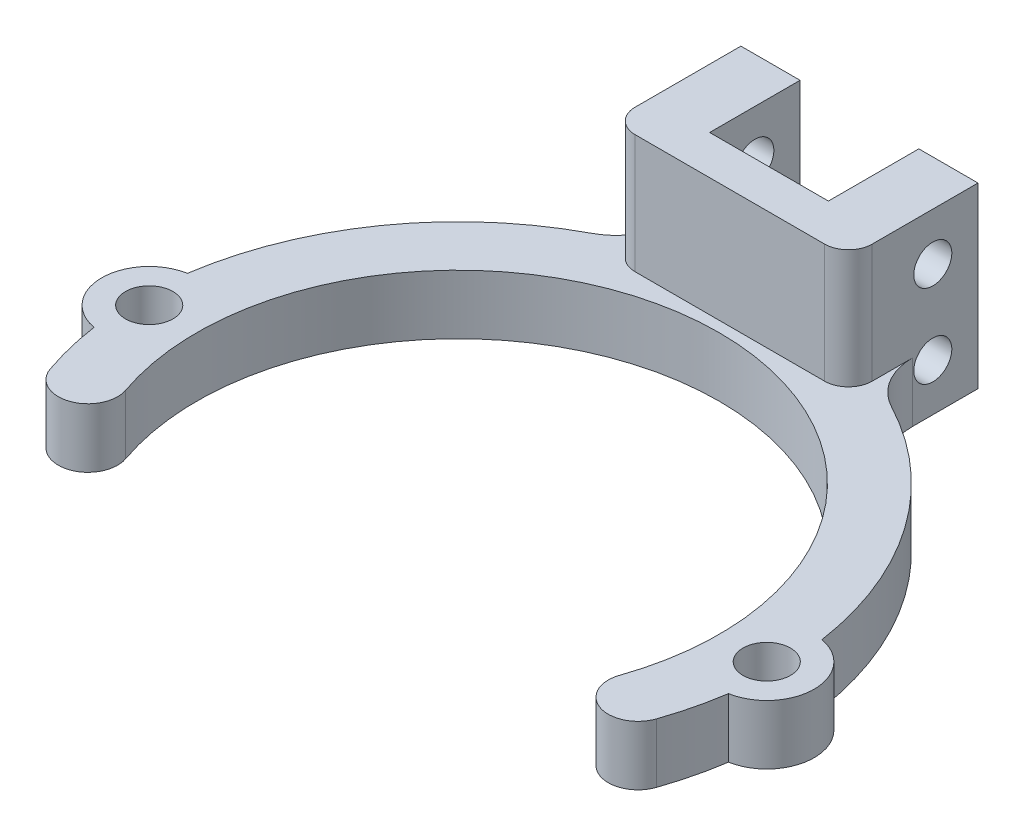
ISO-10303-21;
HEADER;
FILE_DESCRIPTION(('STEP AP214'),'2;1');
FILE_NAME('part.step','',(''),(''),'','','');
FILE_SCHEMA(('AUTOMOTIVE_DESIGN { 1 0 10303 214 1 1 1 1 }'));
ENDSEC;
DATA;
#1=APPLICATION_CONTEXT('core data for automotive mechanical design processes');
#2=APPLICATION_PROTOCOL_DEFINITION('international standard','automotive_design',2000,#1);
#3=PRODUCT_CONTEXT('',#1,'mechanical');
#4=PRODUCT('Part','Part','',(#3));
#5=PRODUCT_RELATED_PRODUCT_CATEGORY('part','',(#4));
#6=PRODUCT_DEFINITION_FORMATION('','',#4);
#7=PRODUCT_DEFINITION_CONTEXT('part definition',#1,'design');
#8=PRODUCT_DEFINITION('design','',#6,#7);
#9=PRODUCT_DEFINITION_SHAPE('','',#8);
#10=(LENGTH_UNIT() NAMED_UNIT(*) SI_UNIT(.MILLI.,.METRE.));
#11=(NAMED_UNIT(*) PLANE_ANGLE_UNIT() SI_UNIT($,.RADIAN.));
#12=(NAMED_UNIT(*) SI_UNIT($,.STERADIAN.) SOLID_ANGLE_UNIT());
#13=UNCERTAINTY_MEASURE_WITH_UNIT(LENGTH_MEASURE(1.E-05),#10,'distance_accuracy_value','');
#14=(GEOMETRIC_REPRESENTATION_CONTEXT(3) GLOBAL_UNCERTAINTY_ASSIGNED_CONTEXT((#13)) GLOBAL_UNIT_ASSIGNED_CONTEXT((#10,
#11,#12)) REPRESENTATION_CONTEXT('',''));
#15=CARTESIAN_POINT('',(0.,0.,0.));
#16=DIRECTION('',(0.,0.,1.));
#17=DIRECTION('',(1.,0.,0.));
#18=AXIS2_PLACEMENT_3D('',#15,#16,#17);
#19=CARTESIAN_POINT('',(-11.5785361769095,5.,3.99999999999988));
#20=DIRECTION('',(0.,1.,0.));
#21=DIRECTION('',(0.,0.,1.));
#22=AXIS2_PLACEMENT_3D('',#19,#20,#21);
#23=PLANE('',#22);
#24=CARTESIAN_POINT('',(-26.,5.,0.));
#25=DIRECTION('',(0.,1.,0.));
#26=DIRECTION('',(0.,0.,1.));
#27=AXIS2_PLACEMENT_3D('',#24,#25,#26);
#28=CIRCLE('',#27,2.);
#29=CARTESIAN_POINT('',(-26.,5.,2.));
#30=VERTEX_POINT('',#29);
#31=EDGE_CURVE('E266',#30,#30,#28,.T.);
#32=ORIENTED_EDGE('',*,*,#31,.F.);
#33=EDGE_LOOP('',(#32));
#34=FACE_BOUND('',#33,.T.);
#35=CARTESIAN_POINT('',(26.,5.,-1.80411241501588E-13));
#36=DIRECTION('',(0.,1.,0.));
#37=DIRECTION('',(0.,0.,-1.));
#38=AXIS2_PLACEMENT_3D('',#35,#36,#37);
#39=CIRCLE('',#38,2.);
#40=CARTESIAN_POINT('',(26.,5.,-2.00000000000018));
#41=VERTEX_POINT('',#40);
#42=EDGE_CURVE('E260',#41,#41,#39,.T.);
#43=ORIENTED_EDGE('',*,*,#42,.F.);
#44=EDGE_LOOP('',(#43));
#45=FACE_BOUND('',#44,.T.);
#46=DIRECTION('',(0.,0.,1.));
#47=VECTOR('',#46,1.);
#48=CARTESIAN_POINT('',(9.98294678168634,5.,3.99999999999988));
#49=LINE('',#48,#47);
#50=CARTESIAN_POINT('',(9.98294678168634,5.,-28.2756309520611));
#51=VERTEX_POINT('',#50);
#52=CARTESIAN_POINT('',(9.98294678168634,5.,-24.8963876711339));
#53=VERTEX_POINT('',#52);
#54=EDGE_CURVE('E252',#51,#53,#49,.T.);
#55=ORIENTED_EDGE('',*,*,#54,.T.);
#56=CARTESIAN_POINT('',(7.98294678168634,5.,-24.8963876711339));
#57=DIRECTION('',(0.,1.,0.));
#58=DIRECTION('',(0.,0.,1.));
#59=AXIS2_PLACEMENT_3D('',#56,#57,#58);
#60=CIRCLE('',#59,2.);
#61=CARTESIAN_POINT('',(7.98294678168634,5.,-22.8963876711339));
#62=VERTEX_POINT('',#61);
#63=EDGE_CURVE('E42',#53,#62,#60,.F.);
#64=ORIENTED_EDGE('',*,*,#63,.T.);
#65=DIRECTION('',(-1.,0.,0.));
#66=VECTOR('',#65,1.);
#67=CARTESIAN_POINT('',(-11.5785361769095,5.,-22.8963876711339));
#68=LINE('',#67,#66);
#69=CARTESIAN_POINT('',(-7.98294678168635,5.,-22.8963876711339));
#70=VERTEX_POINT('',#69);
#71=EDGE_CURVE('E257',#62,#70,#68,.T.);
#72=ORIENTED_EDGE('',*,*,#71,.T.);
#73=CARTESIAN_POINT('',(-7.98294678168635,5.,-24.8963876711339));
#74=DIRECTION('',(0.,1.,0.));
#75=DIRECTION('',(0.,0.,1.));
#76=AXIS2_PLACEMENT_3D('',#73,#74,#75);
#77=CIRCLE('',#76,2.);
#78=CARTESIAN_POINT('',(-9.98294678168635,5.,-24.8963876711339));
#79=VERTEX_POINT('',#78);
#80=EDGE_CURVE('E11',#70,#79,#77,.F.);
#81=ORIENTED_EDGE('',*,*,#80,.T.);
#82=DIRECTION('',(0.,0.,-1.));
#83=VECTOR('',#82,1.);
#84=CARTESIAN_POINT('',(-9.98294678168635,5.,3.99999999999988));
#85=LINE('',#84,#83);
#86=CARTESIAN_POINT('',(-9.98294678168635,5.,-28.2756309520611));
#87=VERTEX_POINT('',#86);
#88=EDGE_CURVE('E255',#79,#87,#85,.T.);
#89=ORIENTED_EDGE('',*,*,#88,.T.);
#90=CARTESIAN_POINT('',(-14.9829467816863,5.,-28.2756309520611));
#91=DIRECTION('',(0.,1.,0.));
#92=DIRECTION('',(0.,0.,1.));
#93=AXIS2_PLACEMENT_3D('',#90,#91,#92);
#94=CIRCLE('',#93,5.);
#95=CARTESIAN_POINT('',(-12.6418613470479,5.,-23.8575636158015));
#96=VERTEX_POINT('',#95);
#97=EDGE_CURVE('E357',#87,#96,#94,.F.);
#98=ORIENTED_EDGE('',*,*,#97,.T.);
#99=CARTESIAN_POINT('',(0.,5.,0.));
#100=DIRECTION('',(0.,1.,0.));
#101=DIRECTION('',(0.,0.,1.));
#102=AXIS2_PLACEMENT_3D('',#99,#100,#101);
#103=CIRCLE('',#102,27.);
#104=CARTESIAN_POINT('',(-26.7115384615385,5.,-3.93620540848054));
#105=VERTEX_POINT('',#104);
#106=EDGE_CURVE('E284',#96,#105,#103,.T.);
#107=ORIENTED_EDGE('',*,*,#106,.T.);
#108=CARTESIAN_POINT('',(-26.,5.,0.));
#109=DIRECTION('',(0.,1.,0.));
#110=DIRECTION('',(0.,0.,1.));
#111=AXIS2_PLACEMENT_3D('',#108,#109,#110);
#112=CIRCLE('',#111,4.);
#113=CARTESIAN_POINT('',(-26.7115384615385,5.,3.93620540848054));
#114=VERTEX_POINT('',#113);
#115=EDGE_CURVE('E288',#105,#114,#112,.T.);
#116=ORIENTED_EDGE('',*,*,#115,.T.);
#117=CARTESIAN_POINT('',(0.,5.,0.));
#118=DIRECTION('',(0.,1.,0.));
#119=DIRECTION('',(0.,0.,1.));
#120=AXIS2_PLACEMENT_3D('',#117,#118,#119);
#121=CIRCLE('',#120,27.);
#122=CARTESIAN_POINT('',(-25.5200389205351,5.,8.81632653061199));
#123=VERTEX_POINT('',#122);
#124=EDGE_CURVE('E290',#114,#123,#121,.T.);
#125=ORIENTED_EDGE('',*,*,#124,.T.);
#126=CARTESIAN_POINT('',(-23.1570723538189,5.,7.99999999999977));
#127=DIRECTION('',(0.,1.,0.));
#128=DIRECTION('',(0.,0.,1.));
#129=AXIS2_PLACEMENT_3D('',#126,#127,#128);
#130=CIRCLE('',#129,2.5);
#131=CARTESIAN_POINT('',(-20.7941057871027,5.,7.18367346938754));
#132=VERTEX_POINT('',#131);
#133=EDGE_CURVE('E272',#123,#132,#130,.T.);
#134=ORIENTED_EDGE('',*,*,#133,.T.);
#135=CARTESIAN_POINT('',(0.,5.,0.));
#136=DIRECTION('',(0.,-1.,0.));
#137=DIRECTION('',(0.,0.,1.));
#138=AXIS2_PLACEMENT_3D('',#135,#136,#137);
#139=CIRCLE('',#138,22.);
#140=CARTESIAN_POINT('',(20.7941057871026,5.,7.18367346938775));
#141=VERTEX_POINT('',#140);
#142=EDGE_CURVE('E275',#132,#141,#139,.T.);
#143=ORIENTED_EDGE('',*,*,#142,.T.);
#144=CARTESIAN_POINT('',(23.1570723538188,5.,8.));
#145=DIRECTION('',(0.,1.,0.));
#146=DIRECTION('',(0.,0.,1.));
#147=AXIS2_PLACEMENT_3D('',#144,#145,#146);
#148=CIRCLE('',#147,2.5);
#149=CARTESIAN_POINT('',(25.520038920535,5.,8.81632653061224));
#150=VERTEX_POINT('',#149);
#151=EDGE_CURVE('E278',#141,#150,#148,.T.);
#152=ORIENTED_EDGE('',*,*,#151,.T.);
#153=CARTESIAN_POINT('',(0.,5.,0.));
#154=DIRECTION('',(0.,1.,0.));
#155=DIRECTION('',(0.,0.,1.));
#156=AXIS2_PLACEMENT_3D('',#153,#154,#155);
#157=CIRCLE('',#156,27.);
#158=CARTESIAN_POINT('',(26.7115384615385,5.,3.93620540848036));
#159=VERTEX_POINT('',#158);
#160=EDGE_CURVE('E280',#150,#159,#157,.T.);
#161=ORIENTED_EDGE('',*,*,#160,.T.);
#162=CARTESIAN_POINT('',(26.,5.,-1.80411241501588E-13));
#163=DIRECTION('',(0.,1.,0.));
#164=DIRECTION('',(0.,0.,-1.));
#165=AXIS2_PLACEMENT_3D('',#162,#163,#164);
#166=CIRCLE('',#165,4.);
#167=CARTESIAN_POINT('',(26.7115384615384,5.,-3.93620540848073));
#168=VERTEX_POINT('',#167);
#169=EDGE_CURVE('E282',#159,#168,#166,.T.);
#170=ORIENTED_EDGE('',*,*,#169,.T.);
#171=CARTESIAN_POINT('',(12.6418613470478,5.,-23.8575636158015));
#172=VERTEX_POINT('',#171);
#173=EDGE_CURVE('E285',#168,#172,#103,.T.);
#174=ORIENTED_EDGE('',*,*,#173,.T.);
#175=CARTESIAN_POINT('',(14.9829467816863,5.,-28.2756309520611));
#176=DIRECTION('',(0.,1.,0.));
#177=DIRECTION('',(0.,0.,1.));
#178=AXIS2_PLACEMENT_3D('',#175,#176,#177);
#179=CIRCLE('',#178,5.);
#180=EDGE_CURVE('E354',#172,#51,#179,.F.);
#181=ORIENTED_EDGE('',*,*,#180,.T.);
#182=EDGE_LOOP('',(#55,#64,#72,#81,#89,#98,#107,#116,#125,#134,#143,#152,#161,#170,#174,#181));
#183=FACE_BOUND('',#182,.T.);
#184=ADVANCED_FACE('F34',(#34,#45,#183),#23,.T.);
#185=CARTESIAN_POINT('',(0.,5.,0.));
#186=DIRECTION('',(0.,-1.,0.));
#187=DIRECTION('',(0.,0.,-1.));
#188=AXIS2_PLACEMENT_3D('',#185,#186,#187);
#189=CYLINDRICAL_SURFACE('',#188,27.);
#190=ORIENTED_EDGE('',*,*,#106,.F.);
#191=DIRECTION('',(0.,-1.,0.));
#192=VECTOR('',#191,1.);
#193=CARTESIAN_POINT('',(-12.6418613470479,5.,-23.8575636158015));
#194=LINE('',#193,#192);
#195=CARTESIAN_POINT('',(-12.6418613470479,0.,-23.8575636158015));
#196=VERTEX_POINT('',#195);
#197=EDGE_CURVE('E350',#96,#196,#194,.T.);
#198=ORIENTED_EDGE('',*,*,#197,.T.);
#199=CARTESIAN_POINT('',(0.,0.,0.));
#200=DIRECTION('',(0.,1.,0.));
#201=DIRECTION('',(0.,0.,1.));
#202=AXIS2_PLACEMENT_3D('',#199,#200,#201);
#203=CIRCLE('',#202,27.);
#204=CARTESIAN_POINT('',(-26.7115384615385,0.,-3.93620540848054));
#205=VERTEX_POINT('',#204);
#206=EDGE_CURVE('E303',#196,#205,#203,.T.);
#207=ORIENTED_EDGE('',*,*,#206,.T.);
#208=DIRECTION('',(0.,-1.,0.));
#209=VECTOR('',#208,1.);
#210=CARTESIAN_POINT('',(-26.7115384615385,5.,-3.93620540848054));
#211=LINE('',#210,#209);
#212=EDGE_CURVE('E315',#105,#205,#211,.T.);
#213=ORIENTED_EDGE('',*,*,#212,.F.);
#214=EDGE_LOOP('',(#190,#198,#207,#213));
#215=FACE_BOUND('',#214,.T.);
#216=ADVANCED_FACE('F461',(#215),#189,.T.);
#217=CARTESIAN_POINT('',(26.7115384615384,0.,-3.93620540848073));
#218=VERTEX_POINT('',#217);
#219=CARTESIAN_POINT('',(12.6418613470478,0.,-23.8575636158015));
#220=VERTEX_POINT('',#219);
#221=EDGE_CURVE('E304',#218,#220,#203,.T.);
#222=ORIENTED_EDGE('',*,*,#221,.T.);
#223=DIRECTION('',(0.,-1.,0.));
#224=VECTOR('',#223,1.);
#225=CARTESIAN_POINT('',(12.6418613470479,5.,-23.8575636158015));
#226=LINE('',#225,#224);
#227=EDGE_CURVE('E345',#220,#172,#226,.F.);
#228=ORIENTED_EDGE('',*,*,#227,.T.);
#229=ORIENTED_EDGE('',*,*,#173,.F.);
#230=DIRECTION('',(0.,-1.,0.));
#231=VECTOR('',#230,1.);
#232=CARTESIAN_POINT('',(26.7115384615384,5.,-3.93620540848073));
#233=LINE('',#232,#231);
#234=EDGE_CURVE('E318',#168,#218,#233,.T.);
#235=ORIENTED_EDGE('',*,*,#234,.T.);
#236=EDGE_LOOP('',(#222,#228,#229,#235));
#237=FACE_BOUND('',#236,.T.);
#238=ADVANCED_FACE('F404',(#237),#189,.T.);
#239=CARTESIAN_POINT('',(-11.5785361769095,0.,3.99999999999988));
#240=DIRECTION('',(0.,1.,0.));
#241=DIRECTION('',(0.,0.,1.));
#242=AXIS2_PLACEMENT_3D('',#239,#240,#241);
#243=PLANE('',#242);
#244=DIRECTION('',(0.,0.,-1.));
#245=VECTOR('',#244,1.);
#246=CARTESIAN_POINT('',(-5.,0.,-26.1929992232642));
#247=LINE('',#246,#245);
#248=CARTESIAN_POINT('',(-5.,0.,-26.1929992232642));
#249=VERTEX_POINT('',#248);
#250=CARTESIAN_POINT('',(-5.,0.,-33.8070007767358));
#251=VERTEX_POINT('',#250);
#252=EDGE_CURVE('E183',#249,#251,#247,.T.);
#253=ORIENTED_EDGE('',*,*,#252,.F.);
#254=DIRECTION('',(1.,0.,0.));
#255=VECTOR('',#254,1.);
#256=CARTESIAN_POINT('',(-5.,0.,-26.1929992232642));
#257=LINE('',#256,#255);
#258=CARTESIAN_POINT('',(4.99999999999999,0.,-26.1929992232642));
#259=VERTEX_POINT('',#258);
#260=EDGE_CURVE('E189',#249,#259,#257,.T.);
#261=ORIENTED_EDGE('',*,*,#260,.T.);
#262=DIRECTION('',(0.,0.,1.));
#263=VECTOR('',#262,1.);
#264=CARTESIAN_POINT('',(4.99999999999999,0.,-26.1929992232642));
#265=LINE('',#264,#263);
#266=CARTESIAN_POINT('',(4.99999999999999,0.,-33.8070007767358));
#267=VERTEX_POINT('',#266);
#268=EDGE_CURVE('E194',#267,#259,#265,.T.);
#269=ORIENTED_EDGE('',*,*,#268,.F.);
#270=DIRECTION('',(-1.,0.,0.));
#271=VECTOR('',#270,1.);
#272=CARTESIAN_POINT('',(9.98294678168634,0.,-33.8070007767358));
#273=LINE('',#272,#271);
#274=CARTESIAN_POINT('',(9.98294678168634,0.,-33.8070007767358));
#275=VERTEX_POINT('',#274);
#276=EDGE_CURVE('E238',#275,#267,#273,.T.);
#277=ORIENTED_EDGE('',*,*,#276,.F.);
#278=DIRECTION('',(0.,0.,-1.));
#279=VECTOR('',#278,1.);
#280=CARTESIAN_POINT('',(9.98294678168634,0.,-22.8963876711339));
#281=LINE('',#280,#279);
#282=CARTESIAN_POINT('',(9.98294678168634,0.,-28.2756309520611));
#283=VERTEX_POINT('',#282);
#284=EDGE_CURVE('E213',#283,#275,#281,.T.);
#285=ORIENTED_EDGE('',*,*,#284,.F.);
#286=CARTESIAN_POINT('',(14.9829467816863,0.,-28.2756309520611));
#287=DIRECTION('',(0.,1.,0.));
#288=DIRECTION('',(0.,0.,1.));
#289=AXIS2_PLACEMENT_3D('',#286,#287,#288);
#290=CIRCLE('',#289,5.);
#291=EDGE_CURVE('E352',#283,#220,#290,.T.);
#292=ORIENTED_EDGE('',*,*,#291,.T.);
#293=ORIENTED_EDGE('',*,*,#221,.F.);
#294=CARTESIAN_POINT('',(26.,0.,-1.80411241501588E-13));
#295=DIRECTION('',(0.,1.,0.));
#296=DIRECTION('',(0.,0.,-1.));
#297=AXIS2_PLACEMENT_3D('',#294,#295,#296);
#298=CIRCLE('',#297,4.);
#299=CARTESIAN_POINT('',(26.7115384615385,0.,3.93620540848036));
#300=VERTEX_POINT('',#299);
#301=EDGE_CURVE('E301',#300,#218,#298,.T.);
#302=ORIENTED_EDGE('',*,*,#301,.F.);
#303=CARTESIAN_POINT('',(0.,0.,0.));
#304=DIRECTION('',(0.,1.,0.));
#305=DIRECTION('',(0.,0.,1.));
#306=AXIS2_PLACEMENT_3D('',#303,#304,#305);
#307=CIRCLE('',#306,27.);
#308=CARTESIAN_POINT('',(25.520038920535,0.,8.81632653061224));
#309=VERTEX_POINT('',#308);
#310=EDGE_CURVE('E299',#309,#300,#307,.T.);
#311=ORIENTED_EDGE('',*,*,#310,.F.);
#312=CARTESIAN_POINT('',(23.1570723538188,0.,8.));
#313=DIRECTION('',(0.,1.,0.));
#314=DIRECTION('',(0.,0.,1.));
#315=AXIS2_PLACEMENT_3D('',#312,#313,#314);
#316=CIRCLE('',#315,2.5);
#317=CARTESIAN_POINT('',(20.7941057871026,0.,7.18367346938775));
#318=VERTEX_POINT('',#317);
#319=EDGE_CURVE('E297',#318,#309,#316,.T.);
#320=ORIENTED_EDGE('',*,*,#319,.F.);
#321=CARTESIAN_POINT('',(0.,0.,0.));
#322=DIRECTION('',(0.,-1.,0.));
#323=DIRECTION('',(0.,0.,1.));
#324=AXIS2_PLACEMENT_3D('',#321,#322,#323);
#325=CIRCLE('',#324,22.);
#326=CARTESIAN_POINT('',(-20.7941057871027,0.,7.18367346938754));
#327=VERTEX_POINT('',#326);
#328=EDGE_CURVE('E295',#327,#318,#325,.T.);
#329=ORIENTED_EDGE('',*,*,#328,.F.);
#330=CARTESIAN_POINT('',(-23.1570723538189,0.,7.99999999999977));
#331=DIRECTION('',(0.,1.,0.));
#332=DIRECTION('',(0.,0.,1.));
#333=AXIS2_PLACEMENT_3D('',#330,#331,#332);
#334=CIRCLE('',#333,2.5);
#335=CARTESIAN_POINT('',(-25.5200389205351,0.,8.81632653061199));
#336=VERTEX_POINT('',#335);
#337=EDGE_CURVE('E269',#336,#327,#334,.T.);
#338=ORIENTED_EDGE('',*,*,#337,.F.);
#339=CARTESIAN_POINT('',(0.,0.,0.));
#340=DIRECTION('',(0.,1.,0.));
#341=DIRECTION('',(0.,0.,1.));
#342=AXIS2_PLACEMENT_3D('',#339,#340,#341);
#343=CIRCLE('',#342,27.);
#344=CARTESIAN_POINT('',(-26.7115384615385,0.,3.93620540848054));
#345=VERTEX_POINT('',#344);
#346=EDGE_CURVE('E276',#345,#336,#343,.T.);
#347=ORIENTED_EDGE('',*,*,#346,.F.);
#348=CARTESIAN_POINT('',(-26.,0.,0.));
#349=DIRECTION('',(0.,1.,0.));
#350=DIRECTION('',(0.,0.,1.));
#351=AXIS2_PLACEMENT_3D('',#348,#349,#350);
#352=CIRCLE('',#351,4.);
#353=EDGE_CURVE('E307',#205,#345,#352,.T.);
#354=ORIENTED_EDGE('',*,*,#353,.F.);
#355=ORIENTED_EDGE('',*,*,#206,.F.);
#356=CARTESIAN_POINT('',(-14.9829467816863,0.,-28.2756309520611));
#357=DIRECTION('',(0.,1.,0.));
#358=DIRECTION('',(0.,0.,1.));
#359=AXIS2_PLACEMENT_3D('',#356,#357,#358);
#360=CIRCLE('',#359,5.);
#361=CARTESIAN_POINT('',(-9.98294678168635,0.,-28.2756309520611));
#362=VERTEX_POINT('',#361);
#363=EDGE_CURVE('E359',#196,#362,#360,.T.);
#364=ORIENTED_EDGE('',*,*,#363,.T.);
#365=DIRECTION('',(0.,0.,1.));
#366=VECTOR('',#365,1.);
#367=CARTESIAN_POINT('',(-9.98294678168635,0.,-22.8963876711339));
#368=LINE('',#367,#366);
#369=CARTESIAN_POINT('',(-9.98294678168635,0.,-33.8070007767358));
#370=VERTEX_POINT('',#369);
#371=EDGE_CURVE('E209',#370,#362,#368,.T.);
#372=ORIENTED_EDGE('',*,*,#371,.F.);
#373=DIRECTION('',(-1.,0.,0.));
#374=VECTOR('',#373,1.);
#375=CARTESIAN_POINT('',(-5.,0.,-33.8070007767358));
#376=LINE('',#375,#374);
#377=EDGE_CURVE('E191',#251,#370,#376,.T.);
#378=ORIENTED_EDGE('',*,*,#377,.F.);
#379=EDGE_LOOP('',(#253,#261,#269,#277,#285,#292,#293,#302,#311,#320,#329,#338,#347,#354,#355,
#364,#372,#378));
#380=FACE_BOUND('',#379,.T.);
#381=CARTESIAN_POINT('',(26.,0.,-1.80411241501588E-13));
#382=DIRECTION('',(0.,1.,0.));
#383=DIRECTION('',(0.,0.,-1.));
#384=AXIS2_PLACEMENT_3D('',#381,#382,#383);
#385=CIRCLE('',#384,2.);
#386=CARTESIAN_POINT('',(26.,0.,-2.00000000000018));
#387=VERTEX_POINT('',#386);
#388=EDGE_CURVE('E259',#387,#387,#385,.T.);
#389=ORIENTED_EDGE('',*,*,#388,.T.);
#390=EDGE_LOOP('',(#389));
#391=FACE_BOUND('',#390,.T.);
#392=CARTESIAN_POINT('',(-26.,0.,0.));
#393=DIRECTION('',(0.,1.,0.));
#394=DIRECTION('',(0.,0.,1.));
#395=AXIS2_PLACEMENT_3D('',#392,#393,#394);
#396=CIRCLE('',#395,2.);
#397=CARTESIAN_POINT('',(-26.,0.,2.));
#398=VERTEX_POINT('',#397);
#399=EDGE_CURVE('E263',#398,#398,#396,.T.);
#400=ORIENTED_EDGE('',*,*,#399,.T.);
#401=EDGE_LOOP('',(#400));
#402=FACE_BOUND('',#401,.T.);
#403=ADVANCED_FACE('F185',(#380,#391,#402),#243,.F.);
#404=CARTESIAN_POINT('',(-23.1570723538189,5.,7.99999999999977));
#405=DIRECTION('',(0.,-1.,0.));
#406=DIRECTION('',(0.,0.,-1.));
#407=AXIS2_PLACEMENT_3D('',#404,#405,#406);
#408=CYLINDRICAL_SURFACE('',#407,2.5);
#409=ORIENTED_EDGE('',*,*,#337,.T.);
#410=DIRECTION('',(0.,-1.,0.));
#411=VECTOR('',#410,1.);
#412=CARTESIAN_POINT('',(-20.7941057871027,5.,7.18367346938754));
#413=LINE('',#412,#411);
#414=EDGE_CURVE('E330',#132,#327,#413,.T.);
#415=ORIENTED_EDGE('',*,*,#414,.F.);
#416=ORIENTED_EDGE('',*,*,#133,.F.);
#417=DIRECTION('',(0.,-1.,0.));
#418=VECTOR('',#417,1.);
#419=CARTESIAN_POINT('',(-25.5200389205351,5.,8.81632653061199));
#420=LINE('',#419,#418);
#421=EDGE_CURVE('E292',#123,#336,#420,.T.);
#422=ORIENTED_EDGE('',*,*,#421,.T.);
#423=EDGE_LOOP('',(#409,#415,#416,#422));
#424=FACE_BOUND('',#423,.T.);
#425=ADVANCED_FACE('F430',(#424),#408,.T.);
#426=CARTESIAN_POINT('',(0.,5.,0.));
#427=DIRECTION('',(0.,-1.,0.));
#428=DIRECTION('',(0.,0.,-1.));
#429=AXIS2_PLACEMENT_3D('',#426,#427,#428);
#430=CYLINDRICAL_SURFACE('',#429,22.);
#431=ORIENTED_EDGE('',*,*,#328,.T.);
#432=DIRECTION('',(0.,-1.,0.));
#433=VECTOR('',#432,1.);
#434=CARTESIAN_POINT('',(20.7941057871026,5.,7.18367346938775));
#435=LINE('',#434,#433);
#436=EDGE_CURVE('E327',#141,#318,#435,.T.);
#437=ORIENTED_EDGE('',*,*,#436,.F.);
#438=ORIENTED_EDGE('',*,*,#142,.F.);
#439=ORIENTED_EDGE('',*,*,#414,.T.);
#440=EDGE_LOOP('',(#431,#437,#438,#439));
#441=FACE_BOUND('',#440,.T.);
#442=ADVANCED_FACE('F424',(#441),#430,.F.);
#443=CARTESIAN_POINT('',(23.1570723538188,5.,8.));
#444=DIRECTION('',(0.,-1.,0.));
#445=DIRECTION('',(0.,0.,-1.));
#446=AXIS2_PLACEMENT_3D('',#443,#444,#445);
#447=CYLINDRICAL_SURFACE('',#446,2.5);
#448=ORIENTED_EDGE('',*,*,#319,.T.);
#449=DIRECTION('',(0.,-1.,0.));
#450=VECTOR('',#449,1.);
#451=CARTESIAN_POINT('',(25.520038920535,5.,8.81632653061224));
#452=LINE('',#451,#450);
#453=EDGE_CURVE('E324',#150,#309,#452,.T.);
#454=ORIENTED_EDGE('',*,*,#453,.F.);
#455=ORIENTED_EDGE('',*,*,#151,.F.);
#456=ORIENTED_EDGE('',*,*,#436,.T.);
#457=EDGE_LOOP('',(#448,#454,#455,#456));
#458=FACE_BOUND('',#457,.T.);
#459=ADVANCED_FACE('F421',(#458),#447,.T.);
#460=CARTESIAN_POINT('',(0.,5.,0.));
#461=DIRECTION('',(0.,-1.,0.));
#462=DIRECTION('',(0.,0.,-1.));
#463=AXIS2_PLACEMENT_3D('',#460,#461,#462);
#464=CYLINDRICAL_SURFACE('',#463,27.);
#465=ORIENTED_EDGE('',*,*,#310,.T.);
#466=DIRECTION('',(0.,-1.,0.));
#467=VECTOR('',#466,1.);
#468=CARTESIAN_POINT('',(26.7115384615385,5.,3.93620540848036));
#469=LINE('',#468,#467);
#470=EDGE_CURVE('E321',#159,#300,#469,.T.);
#471=ORIENTED_EDGE('',*,*,#470,.F.);
#472=ORIENTED_EDGE('',*,*,#160,.F.);
#473=ORIENTED_EDGE('',*,*,#453,.T.);
#474=EDGE_LOOP('',(#465,#471,#472,#473));
#475=FACE_BOUND('',#474,.T.);
#476=ADVANCED_FACE('F417',(#475),#464,.T.);
#477=CARTESIAN_POINT('',(26.,5.,-1.80411241501588E-13));
#478=DIRECTION('',(0.,-1.,0.));
#479=DIRECTION('',(0.,0.,-1.));
#480=AXIS2_PLACEMENT_3D('',#477,#478,#479);
#481=CYLINDRICAL_SURFACE('',#480,4.);
#482=ORIENTED_EDGE('',*,*,#301,.T.);
#483=ORIENTED_EDGE('',*,*,#234,.F.);
#484=ORIENTED_EDGE('',*,*,#169,.F.);
#485=ORIENTED_EDGE('',*,*,#470,.T.);
#486=EDGE_LOOP('',(#482,#483,#484,#485));
#487=FACE_BOUND('',#486,.T.);
#488=ADVANCED_FACE('F413',(#487),#481,.T.);
#489=CARTESIAN_POINT('',(-26.,5.,0.));
#490=DIRECTION('',(0.,-1.,0.));
#491=DIRECTION('',(0.,0.,-1.));
#492=AXIS2_PLACEMENT_3D('',#489,#490,#491);
#493=CYLINDRICAL_SURFACE('',#492,4.);
#494=ORIENTED_EDGE('',*,*,#353,.T.);
#495=DIRECTION('',(0.,-1.,0.));
#496=VECTOR('',#495,1.);
#497=CARTESIAN_POINT('',(-26.7115384615385,5.,3.93620540848054));
#498=LINE('',#497,#496);
#499=EDGE_CURVE('E312',#114,#345,#498,.T.);
#500=ORIENTED_EDGE('',*,*,#499,.F.);
#501=ORIENTED_EDGE('',*,*,#115,.F.);
#502=ORIENTED_EDGE('',*,*,#212,.T.);
#503=EDGE_LOOP('',(#494,#500,#501,#502));
#504=FACE_BOUND('',#503,.T.);
#505=ADVANCED_FACE('F439',(#504),#493,.T.);
#506=CARTESIAN_POINT('',(0.,5.,0.));
#507=DIRECTION('',(0.,-1.,0.));
#508=DIRECTION('',(0.,0.,-1.));
#509=AXIS2_PLACEMENT_3D('',#506,#507,#508);
#510=CYLINDRICAL_SURFACE('',#509,27.);
#511=ORIENTED_EDGE('',*,*,#346,.T.);
#512=ORIENTED_EDGE('',*,*,#421,.F.);
#513=ORIENTED_EDGE('',*,*,#124,.F.);
#514=ORIENTED_EDGE('',*,*,#499,.T.);
#515=EDGE_LOOP('',(#511,#512,#513,#514));
#516=FACE_BOUND('',#515,.T.);
#517=ADVANCED_FACE('F435',(#516),#510,.T.);
#518=CARTESIAN_POINT('',(-26.,5.,0.));
#519=DIRECTION('',(0.,-1.,0.));
#520=DIRECTION('',(0.,0.,-1.));
#521=AXIS2_PLACEMENT_3D('',#518,#519,#520);
#522=CYLINDRICAL_SURFACE('',#521,2.);
#523=ORIENTED_EDGE('',*,*,#31,.T.);
#524=EDGE_LOOP('',(#523));
#525=FACE_BOUND('',#524,.T.);
#526=ORIENTED_EDGE('',*,*,#399,.F.);
#527=EDGE_LOOP('',(#526));
#528=FACE_BOUND('',#527,.T.);
#529=ADVANCED_FACE('F472',(#525,#528),#522,.F.);
#530=CARTESIAN_POINT('',(26.,5.,-1.80411241501588E-13));
#531=DIRECTION('',(0.,-1.,0.));
#532=DIRECTION('',(0.,0.,-1.));
#533=AXIS2_PLACEMENT_3D('',#530,#531,#532);
#534=CYLINDRICAL_SURFACE('',#533,2.);
#535=ORIENTED_EDGE('',*,*,#42,.T.);
#536=EDGE_LOOP('',(#535));
#537=FACE_BOUND('',#536,.T.);
#538=ORIENTED_EDGE('',*,*,#388,.F.);
#539=EDGE_LOOP('',(#538));
#540=FACE_BOUND('',#539,.T.);
#541=ADVANCED_FACE('F547',(#537,#540),#534,.F.);
#542=CARTESIAN_POINT('',(-9.98294678168635,15.,-22.8963876711339));
#543=DIRECTION('',(1.,0.,0.));
#544=DIRECTION('',(0.,0.,-1.));
#545=AXIS2_PLACEMENT_3D('',#542,#543,#544);
#546=PLANE('',#545);
#547=CARTESIAN_POINT('',(-9.98294678168635,4.,-30.));
#548=DIRECTION('',(-1.,0.,0.));
#549=DIRECTION('',(0.,0.,1.));
#550=AXIS2_PLACEMENT_3D('',#547,#548,#549);
#551=CIRCLE('',#550,1.6);
#552=CARTESIAN_POINT('',(-9.98294678168635,4.,-28.4));
#553=VERTEX_POINT('',#552);
#554=EDGE_CURVE('E338',#553,#553,#551,.T.);
#555=ORIENTED_EDGE('',*,*,#554,.F.);
#556=EDGE_LOOP('',(#555));
#557=FACE_BOUND('',#556,.T.);
#558=CARTESIAN_POINT('',(-9.98294678168635,11.,-30.));
#559=DIRECTION('',(-1.,0.,0.));
#560=DIRECTION('',(0.,0.,1.));
#561=AXIS2_PLACEMENT_3D('',#558,#559,#560);
#562=CIRCLE('',#561,1.6);
#563=CARTESIAN_POINT('',(-9.98294678168635,11.,-28.4));
#564=VERTEX_POINT('',#563);
#565=EDGE_CURVE('E738',#564,#564,#562,.T.);
#566=ORIENTED_EDGE('',*,*,#565,.F.);
#567=EDGE_LOOP('',(#566));
#568=FACE_BOUND('',#567,.T.);
#569=ORIENTED_EDGE('',*,*,#88,.F.);
#570=DIRECTION('',(0.,-1.,0.));
#571=VECTOR('',#570,1.);
#572=CARTESIAN_POINT('',(-9.98294678168635,15.,-24.8963876711339));
#573=LINE('',#572,#571);
#574=CARTESIAN_POINT('',(-9.98294678168635,15.,-24.8963876711339));
#575=VERTEX_POINT('',#574);
#576=EDGE_CURVE('E54',#79,#575,#573,.F.);
#577=ORIENTED_EDGE('',*,*,#576,.T.);
#578=DIRECTION('',(0.,0.,1.));
#579=VECTOR('',#578,1.);
#580=CARTESIAN_POINT('',(-9.98294678168635,15.,-22.8963876711339));
#581=LINE('',#580,#579);
#582=CARTESIAN_POINT('',(-9.98294678168635,15.,-33.8070007767358));
#583=VERTEX_POINT('',#582);
#584=EDGE_CURVE('E220',#583,#575,#581,.T.);
#585=ORIENTED_EDGE('',*,*,#584,.F.);
#586=DIRECTION('',(0.,-1.,0.));
#587=VECTOR('',#586,1.);
#588=CARTESIAN_POINT('',(-9.98294678168635,15.,-33.8070007767358));
#589=LINE('',#588,#587);
#590=EDGE_CURVE('E235',#583,#370,#589,.T.);
#591=ORIENTED_EDGE('',*,*,#590,.T.);
#592=ORIENTED_EDGE('',*,*,#371,.T.);
#593=DIRECTION('',(0.,1.,0.));
#594=VECTOR('',#593,1.);
#595=CARTESIAN_POINT('',(-9.98294678168635,5.,-28.2756309520611));
#596=LINE('',#595,#594);
#597=EDGE_CURVE('E347',#362,#87,#596,.T.);
#598=ORIENTED_EDGE('',*,*,#597,.T.);
#599=EDGE_LOOP('',(#569,#577,#585,#591,#592,#598));
#600=FACE_BOUND('',#599,.T.);
#601=ADVANCED_FACE('F449',(#557,#568,#600),#546,.F.);
#602=CARTESIAN_POINT('',(9.98294678168634,15.,-22.8963876711339));
#603=DIRECTION('',(0.,0.,-1.));
#604=DIRECTION('',(-1.,0.,0.));
#605=AXIS2_PLACEMENT_3D('',#602,#603,#604);
#606=PLANE('',#605);
#607=ORIENTED_EDGE('',*,*,#71,.F.);
#608=DIRECTION('',(0.,-1.,0.));
#609=VECTOR('',#608,1.);
#610=CARTESIAN_POINT('',(7.98294678168634,15.,-22.8963876711339));
#611=LINE('',#610,#609);
#612=CARTESIAN_POINT('',(7.98294678168634,15.,-22.8963876711339));
#613=VERTEX_POINT('',#612);
#614=EDGE_CURVE('E367',#62,#613,#611,.F.);
#615=ORIENTED_EDGE('',*,*,#614,.T.);
#616=DIRECTION('',(1.,0.,0.));
#617=VECTOR('',#616,1.);
#618=CARTESIAN_POINT('',(9.98294678168634,15.,-22.8963876711339));
#619=LINE('',#618,#617);
#620=CARTESIAN_POINT('',(-7.98294678168634,15.,-22.8963876711339));
#621=VERTEX_POINT('',#620);
#622=EDGE_CURVE('E222',#621,#613,#619,.T.);
#623=ORIENTED_EDGE('',*,*,#622,.F.);
#624=DIRECTION('',(0.,-1.,0.));
#625=VECTOR('',#624,1.);
#626=CARTESIAN_POINT('',(-7.98294678168635,15.,-22.8963876711339));
#627=LINE('',#626,#625);
#628=EDGE_CURVE('E364',#621,#70,#627,.T.);
#629=ORIENTED_EDGE('',*,*,#628,.T.);
#630=EDGE_LOOP('',(#607,#615,#623,#629));
#631=FACE_BOUND('',#630,.T.);
#632=ADVANCED_FACE('F378',(#631),#606,.F.);
#633=CARTESIAN_POINT('',(9.98294678168634,15.,-22.8963876711339));
#634=DIRECTION('',(-1.,0.,0.));
#635=DIRECTION('',(0.,0.,1.));
#636=AXIS2_PLACEMENT_3D('',#633,#634,#635);
#637=PLANE('',#636);
#638=CARTESIAN_POINT('',(9.98294678168634,4.,-30.));
#639=DIRECTION('',(-1.,0.,0.));
#640=DIRECTION('',(0.,0.,1.));
#641=AXIS2_PLACEMENT_3D('',#638,#639,#640);
#642=CIRCLE('',#641,1.6);
#643=CARTESIAN_POINT('',(9.98294678168634,4.,-28.4));
#644=VERTEX_POINT('',#643);
#645=EDGE_CURVE('E210',#644,#644,#642,.T.);
#646=ORIENTED_EDGE('',*,*,#645,.T.);
#647=EDGE_LOOP('',(#646));
#648=FACE_BOUND('',#647,.T.);
#649=CARTESIAN_POINT('',(9.98294678168634,11.,-30.));
#650=DIRECTION('',(-1.,0.,0.));
#651=DIRECTION('',(0.,0.,1.));
#652=AXIS2_PLACEMENT_3D('',#649,#650,#651);
#653=CIRCLE('',#652,1.6);
#654=CARTESIAN_POINT('',(9.98294678168634,11.,-28.4));
#655=VERTEX_POINT('',#654);
#656=EDGE_CURVE('E342',#655,#655,#653,.T.);
#657=ORIENTED_EDGE('',*,*,#656,.T.);
#658=EDGE_LOOP('',(#657));
#659=FACE_BOUND('',#658,.T.);
#660=DIRECTION('',(0.,0.,-1.));
#661=VECTOR('',#660,1.);
#662=CARTESIAN_POINT('',(9.98294678168634,15.,-22.8963876711339));
#663=LINE('',#662,#661);
#664=CARTESIAN_POINT('',(9.98294678168634,15.,-24.8963876711339));
#665=VERTEX_POINT('',#664);
#666=CARTESIAN_POINT('',(9.98294678168634,15.,-33.8070007767358));
#667=VERTEX_POINT('',#666);
#668=EDGE_CURVE('E225',#665,#667,#663,.T.);
#669=ORIENTED_EDGE('',*,*,#668,.F.);
#670=DIRECTION('',(0.,-1.,0.));
#671=VECTOR('',#670,1.);
#672=CARTESIAN_POINT('',(9.98294678168634,15.,-24.8963876711339));
#673=LINE('',#672,#671);
#674=EDGE_CURVE('E361',#665,#53,#673,.T.);
#675=ORIENTED_EDGE('',*,*,#674,.T.);
#676=ORIENTED_EDGE('',*,*,#54,.F.);
#677=DIRECTION('',(0.,1.,0.));
#678=VECTOR('',#677,1.);
#679=CARTESIAN_POINT('',(9.98294678168634,0.,-28.2756309520611));
#680=LINE('',#679,#678);
#681=EDGE_CURVE('E333',#51,#283,#680,.F.);
#682=ORIENTED_EDGE('',*,*,#681,.T.);
#683=ORIENTED_EDGE('',*,*,#284,.T.);
#684=DIRECTION('',(0.,-1.,0.));
#685=VECTOR('',#684,1.);
#686=CARTESIAN_POINT('',(9.98294678168634,15.,-33.8070007767358));
#687=LINE('',#686,#685);
#688=EDGE_CURVE('E249',#667,#275,#687,.T.);
#689=ORIENTED_EDGE('',*,*,#688,.F.);
#690=EDGE_LOOP('',(#669,#675,#676,#682,#683,#689));
#691=FACE_BOUND('',#690,.T.);
#692=ADVANCED_FACE('F388',(#648,#659,#691),#637,.F.);
#693=CARTESIAN_POINT('',(9.98294678168634,15.,-33.8070007767358));
#694=DIRECTION('',(0.,0.,1.));
#695=DIRECTION('',(1.,0.,0.));
#696=AXIS2_PLACEMENT_3D('',#693,#694,#695);
#697=PLANE('',#696);
#698=ORIENTED_EDGE('',*,*,#276,.T.);
#699=DIRECTION('',(0.,-1.,0.));
#700=VECTOR('',#699,1.);
#701=CARTESIAN_POINT('',(4.99999999999999,15.,-33.8070007767358));
#702=LINE('',#701,#700);
#703=CARTESIAN_POINT('',(4.99999999999999,15.,-33.8070007767358));
#704=VERTEX_POINT('',#703);
#705=EDGE_CURVE('E247',#704,#267,#702,.T.);
#706=ORIENTED_EDGE('',*,*,#705,.F.);
#707=DIRECTION('',(-1.,0.,0.));
#708=VECTOR('',#707,1.);
#709=CARTESIAN_POINT('',(9.98294678168634,15.,-33.8070007767358));
#710=LINE('',#709,#708);
#711=EDGE_CURVE('E227',#667,#704,#710,.T.);
#712=ORIENTED_EDGE('',*,*,#711,.F.);
#713=ORIENTED_EDGE('',*,*,#688,.T.);
#714=EDGE_LOOP('',(#698,#706,#712,#713));
#715=FACE_BOUND('',#714,.T.);
#716=ADVANCED_FACE('F394',(#715),#697,.F.);
#717=CARTESIAN_POINT('',(4.99999999999999,15.,-26.1929992232642));
#718=DIRECTION('',(1.,0.,0.));
#719=DIRECTION('',(0.,0.,-1.));
#720=AXIS2_PLACEMENT_3D('',#717,#718,#719);
#721=PLANE('',#720);
#722=CARTESIAN_POINT('',(4.99999999999999,4.,-30.));
#723=DIRECTION('',(1.,0.,0.));
#724=DIRECTION('',(0.,0.,-1.));
#725=AXIS2_PLACEMENT_3D('',#722,#723,#724);
#726=CIRCLE('',#725,1.6);
#727=CARTESIAN_POINT('',(4.99999999999999,4.,-31.6));
#728=VERTEX_POINT('',#727);
#729=EDGE_CURVE('E216',#728,#728,#726,.T.);
#730=ORIENTED_EDGE('',*,*,#729,.T.);
#731=EDGE_LOOP('',(#730));
#732=FACE_BOUND('',#731,.T.);
#733=CARTESIAN_POINT('',(4.99999999999999,11.,-30.));
#734=DIRECTION('',(1.,0.,0.));
#735=DIRECTION('',(0.,0.,-1.));
#736=AXIS2_PLACEMENT_3D('',#733,#734,#735);
#737=CIRCLE('',#736,1.6);
#738=CARTESIAN_POINT('',(4.99999999999999,11.,-31.6));
#739=VERTEX_POINT('',#738);
#740=EDGE_CURVE('E337',#739,#739,#737,.T.);
#741=ORIENTED_EDGE('',*,*,#740,.T.);
#742=EDGE_LOOP('',(#741));
#743=FACE_BOUND('',#742,.T.);
#744=ORIENTED_EDGE('',*,*,#268,.T.);
#745=DIRECTION('',(0.,-1.,0.));
#746=VECTOR('',#745,1.);
#747=CARTESIAN_POINT('',(4.99999999999999,15.,-26.1929992232642));
#748=LINE('',#747,#746);
#749=CARTESIAN_POINT('',(4.99999999999999,15.,-26.1929992232642));
#750=VERTEX_POINT('',#749);
#751=EDGE_CURVE('E203',#750,#259,#748,.T.);
#752=ORIENTED_EDGE('',*,*,#751,.F.);
#753=DIRECTION('',(0.,0.,1.));
#754=VECTOR('',#753,1.);
#755=CARTESIAN_POINT('',(4.99999999999999,15.,-26.1929992232642));
#756=LINE('',#755,#754);
#757=EDGE_CURVE('E229',#704,#750,#756,.T.);
#758=ORIENTED_EDGE('',*,*,#757,.F.);
#759=ORIENTED_EDGE('',*,*,#705,.T.);
#760=EDGE_LOOP('',(#744,#752,#758,#759));
#761=FACE_BOUND('',#760,.T.);
#762=ADVANCED_FACE('F397',(#732,#743,#761),#721,.F.);
#763=CARTESIAN_POINT('',(4.99999999999999,15.,-26.1929992232642));
#764=DIRECTION('',(0.,0.,1.));
#765=DIRECTION('',(1.,0.,0.));
#766=AXIS2_PLACEMENT_3D('',#763,#764,#765);
#767=PLANE('',#766);
#768=ORIENTED_EDGE('',*,*,#751,.T.);
#769=ORIENTED_EDGE('',*,*,#260,.F.);
#770=DIRECTION('',(0.,-1.,0.));
#771=VECTOR('',#770,1.);
#772=CARTESIAN_POINT('',(-5.,15.,-26.1929992232642));
#773=LINE('',#772,#771);
#774=CARTESIAN_POINT('',(-5.,15.,-26.1929992232642));
#775=VERTEX_POINT('',#774);
#776=EDGE_CURVE('E198',#775,#249,#773,.T.);
#777=ORIENTED_EDGE('',*,*,#776,.F.);
#778=DIRECTION('',(-1.,0.,0.));
#779=VECTOR('',#778,1.);
#780=CARTESIAN_POINT('',(4.99999999999999,15.,-26.1929992232642));
#781=LINE('',#780,#779);
#782=EDGE_CURVE('E231',#750,#775,#781,.T.);
#783=ORIENTED_EDGE('',*,*,#782,.F.);
#784=EDGE_LOOP('',(#768,#769,#777,#783));
#785=FACE_BOUND('',#784,.T.);
#786=ADVANCED_FACE('F207',(#785),#767,.F.);
#787=CARTESIAN_POINT('',(-5.,15.,-26.1929992232642));
#788=DIRECTION('',(-1.,0.,0.));
#789=DIRECTION('',(0.,0.,1.));
#790=AXIS2_PLACEMENT_3D('',#787,#788,#789);
#791=PLANE('',#790);
#792=CARTESIAN_POINT('',(-5.,4.,-30.));
#793=DIRECTION('',(-1.,0.,0.));
#794=DIRECTION('',(0.,0.,1.));
#795=AXIS2_PLACEMENT_3D('',#792,#793,#794);
#796=CIRCLE('',#795,1.6);
#797=CARTESIAN_POINT('',(-5.,4.,-28.4));
#798=VERTEX_POINT('',#797);
#799=EDGE_CURVE('E339',#798,#798,#796,.T.);
#800=ORIENTED_EDGE('',*,*,#799,.T.);
#801=EDGE_LOOP('',(#800));
#802=FACE_BOUND('',#801,.T.);
#803=CARTESIAN_POINT('',(-5.,11.,-30.));
#804=DIRECTION('',(-1.,0.,0.));
#805=DIRECTION('',(0.,0.,1.));
#806=AXIS2_PLACEMENT_3D('',#803,#804,#805);
#807=CIRCLE('',#806,1.6);
#808=CARTESIAN_POINT('',(-5.,11.,-28.4));
#809=VERTEX_POINT('',#808);
#810=EDGE_CURVE('E334',#809,#809,#807,.T.);
#811=ORIENTED_EDGE('',*,*,#810,.T.);
#812=EDGE_LOOP('',(#811));
#813=FACE_BOUND('',#812,.T.);
#814=ORIENTED_EDGE('',*,*,#776,.T.);
#815=ORIENTED_EDGE('',*,*,#252,.T.);
#816=DIRECTION('',(0.,-1.,0.));
#817=VECTOR('',#816,1.);
#818=CARTESIAN_POINT('',(-5.,15.,-33.8070007767358));
#819=LINE('',#818,#817);
#820=CARTESIAN_POINT('',(-5.,15.,-33.8070007767358));
#821=VERTEX_POINT('',#820);
#822=EDGE_CURVE('E204',#821,#251,#819,.T.);
#823=ORIENTED_EDGE('',*,*,#822,.F.);
#824=DIRECTION('',(0.,0.,-1.));
#825=VECTOR('',#824,1.);
#826=CARTESIAN_POINT('',(-5.,15.,-26.1929992232642));
#827=LINE('',#826,#825);
#828=EDGE_CURVE('E200',#775,#821,#827,.T.);
#829=ORIENTED_EDGE('',*,*,#828,.F.);
#830=EDGE_LOOP('',(#814,#815,#823,#829));
#831=FACE_BOUND('',#830,.T.);
#832=ADVANCED_FACE('F199',(#802,#813,#831),#791,.F.);
#833=CARTESIAN_POINT('',(-5.,15.,-33.8070007767358));
#834=DIRECTION('',(0.,0.,1.));
#835=DIRECTION('',(1.,0.,0.));
#836=AXIS2_PLACEMENT_3D('',#833,#834,#835);
#837=PLANE('',#836);
#838=ORIENTED_EDGE('',*,*,#377,.T.);
#839=ORIENTED_EDGE('',*,*,#590,.F.);
#840=DIRECTION('',(-1.,0.,0.));
#841=VECTOR('',#840,1.);
#842=CARTESIAN_POINT('',(-5.,15.,-33.8070007767358));
#843=LINE('',#842,#841);
#844=EDGE_CURVE('E234',#821,#583,#843,.T.);
#845=ORIENTED_EDGE('',*,*,#844,.F.);
#846=ORIENTED_EDGE('',*,*,#822,.T.);
#847=EDGE_LOOP('',(#838,#839,#845,#846));
#848=FACE_BOUND('',#847,.T.);
#849=ADVANCED_FACE('F453',(#848),#837,.F.);
#850=CARTESIAN_POINT('',(0.,15.,0.));
#851=DIRECTION('',(0.,1.,0.));
#852=DIRECTION('',(0.,0.,1.));
#853=AXIS2_PLACEMENT_3D('',#850,#851,#852);
#854=PLANE('',#853);
#855=ORIENTED_EDGE('',*,*,#622,.T.);
#856=CARTESIAN_POINT('',(7.98294678168634,15.,-24.8963876711339));
#857=DIRECTION('',(0.,1.,0.));
#858=DIRECTION('',(0.,0.,1.));
#859=AXIS2_PLACEMENT_3D('',#856,#857,#858);
#860=CIRCLE('',#859,2.);
#861=EDGE_CURVE('E371',#613,#665,#860,.T.);
#862=ORIENTED_EDGE('',*,*,#861,.T.);
#863=ORIENTED_EDGE('',*,*,#668,.T.);
#864=ORIENTED_EDGE('',*,*,#711,.T.);
#865=ORIENTED_EDGE('',*,*,#757,.T.);
#866=ORIENTED_EDGE('',*,*,#782,.T.);
#867=ORIENTED_EDGE('',*,*,#828,.T.);
#868=ORIENTED_EDGE('',*,*,#844,.T.);
#869=ORIENTED_EDGE('',*,*,#584,.T.);
#870=CARTESIAN_POINT('',(-7.98294678168635,15.,-24.8963876711339));
#871=DIRECTION('',(0.,1.,0.));
#872=DIRECTION('',(0.,0.,1.));
#873=AXIS2_PLACEMENT_3D('',#870,#871,#872);
#874=CIRCLE('',#873,2.);
#875=EDGE_CURVE('E369',#575,#621,#874,.T.);
#876=ORIENTED_EDGE('',*,*,#875,.T.);
#877=EDGE_LOOP('',(#855,#862,#863,#864,#865,#866,#867,#868,#869,#876));
#878=FACE_BOUND('',#877,.T.);
#879=ADVANCED_FACE('F385',(#878),#854,.T.);
#880=CARTESIAN_POINT('',(30.,11.,-30.));
#881=DIRECTION('',(-1.,0.,0.));
#882=DIRECTION('',(0.,0.,1.));
#883=AXIS2_PLACEMENT_3D('',#880,#881,#882);
#884=CYLINDRICAL_SURFACE('',#883,1.6);
#885=ORIENTED_EDGE('',*,*,#565,.T.);
#886=EDGE_LOOP('',(#885));
#887=FACE_BOUND('',#886,.T.);
#888=ORIENTED_EDGE('',*,*,#810,.F.);
#889=EDGE_LOOP('',(#888));
#890=FACE_BOUND('',#889,.T.);
#891=ADVANCED_FACE('F516',(#887,#890),#884,.F.);
#892=CARTESIAN_POINT('',(30.,4.,-30.));
#893=DIRECTION('',(-1.,0.,0.));
#894=DIRECTION('',(0.,0.,1.));
#895=AXIS2_PLACEMENT_3D('',#892,#893,#894);
#896=CYLINDRICAL_SURFACE('',#895,1.6);
#897=ORIENTED_EDGE('',*,*,#554,.T.);
#898=EDGE_LOOP('',(#897));
#899=FACE_BOUND('',#898,.T.);
#900=ORIENTED_EDGE('',*,*,#799,.F.);
#901=EDGE_LOOP('',(#900));
#902=FACE_BOUND('',#901,.T.);
#903=ADVANCED_FACE('F592',(#899,#902),#896,.F.);
#904=ORIENTED_EDGE('',*,*,#740,.F.);
#905=EDGE_LOOP('',(#904));
#906=FACE_BOUND('',#905,.T.);
#907=ORIENTED_EDGE('',*,*,#656,.F.);
#908=EDGE_LOOP('',(#907));
#909=FACE_BOUND('',#908,.T.);
#910=ADVANCED_FACE('F589',(#906,#909),#884,.F.);
#911=ORIENTED_EDGE('',*,*,#729,.F.);
#912=EDGE_LOOP('',(#911));
#913=FACE_BOUND('',#912,.T.);
#914=ORIENTED_EDGE('',*,*,#645,.F.);
#915=EDGE_LOOP('',(#914));
#916=FACE_BOUND('',#915,.T.);
#917=ADVANCED_FACE('F492',(#913,#916),#896,.F.);
#918=CARTESIAN_POINT('',(14.9829467816863,5.,-28.2756309520611));
#919=DIRECTION('',(0.,-1.,0.));
#920=DIRECTION('',(0.,0.,-1.));
#921=AXIS2_PLACEMENT_3D('',#918,#919,#920);
#922=CYLINDRICAL_SURFACE('',#921,5.);
#923=ORIENTED_EDGE('',*,*,#180,.F.);
#924=ORIENTED_EDGE('',*,*,#227,.F.);
#925=ORIENTED_EDGE('',*,*,#291,.F.);
#926=ORIENTED_EDGE('',*,*,#681,.F.);
#927=EDGE_LOOP('',(#923,#924,#925,#926));
#928=FACE_BOUND('',#927,.T.);
#929=ADVANCED_FACE('F408',(#928),#922,.F.);
#930=CARTESIAN_POINT('',(-14.9829467816863,5.,-28.2756309520611));
#931=DIRECTION('',(0.,-1.,0.));
#932=DIRECTION('',(0.,0.,-1.));
#933=AXIS2_PLACEMENT_3D('',#930,#931,#932);
#934=CYLINDRICAL_SURFACE('',#933,5.);
#935=ORIENTED_EDGE('',*,*,#363,.F.);
#936=ORIENTED_EDGE('',*,*,#197,.F.);
#937=ORIENTED_EDGE('',*,*,#97,.F.);
#938=ORIENTED_EDGE('',*,*,#597,.F.);
#939=EDGE_LOOP('',(#935,#936,#937,#938));
#940=FACE_BOUND('',#939,.T.);
#941=ADVANCED_FACE('F447',(#940),#934,.F.);
#942=CARTESIAN_POINT('',(7.98294678168634,15.,-24.8963876711339));
#943=DIRECTION('',(0.,-1.,0.));
#944=DIRECTION('',(0.,0.,-1.));
#945=AXIS2_PLACEMENT_3D('',#942,#943,#944);
#946=CYLINDRICAL_SURFACE('',#945,2.);
#947=ORIENTED_EDGE('',*,*,#861,.F.);
#948=ORIENTED_EDGE('',*,*,#614,.F.);
#949=ORIENTED_EDGE('',*,*,#63,.F.);
#950=ORIENTED_EDGE('',*,*,#674,.F.);
#951=EDGE_LOOP('',(#947,#948,#949,#950));
#952=FACE_BOUND('',#951,.T.);
#953=ADVANCED_FACE('F382',(#952),#946,.T.);
#954=CARTESIAN_POINT('',(-7.98294678168635,15.,-24.8963876711339));
#955=DIRECTION('',(0.,-1.,0.));
#956=DIRECTION('',(0.,0.,-1.));
#957=AXIS2_PLACEMENT_3D('',#954,#955,#956);
#958=CYLINDRICAL_SURFACE('',#957,2.);
#959=ORIENTED_EDGE('',*,*,#875,.F.);
#960=ORIENTED_EDGE('',*,*,#576,.F.);
#961=ORIENTED_EDGE('',*,*,#80,.F.);
#962=ORIENTED_EDGE('',*,*,#628,.F.);
#963=EDGE_LOOP('',(#959,#960,#961,#962));
#964=FACE_BOUND('',#963,.T.);
#965=ADVANCED_FACE('F36',(#964),#958,.T.);
#966=CLOSED_SHELL('',(#184,#216,#238,#403,#425,#442,#459,#476,#488,#505,#517,#529,#541,#601,
#632,#692,#716,#762,#786,#832,#849,#879,#891,#903,#910,#917,#929,#941,#953,#965));
#967=MANIFOLD_SOLID_BREP('B2',#966);
#968=ADVANCED_BREP_SHAPE_REPRESENTATION('',(#18,#967),#14);
#969=SHAPE_DEFINITION_REPRESENTATION(#9,#968);
ENDSEC;
END-ISO-10303-21;
